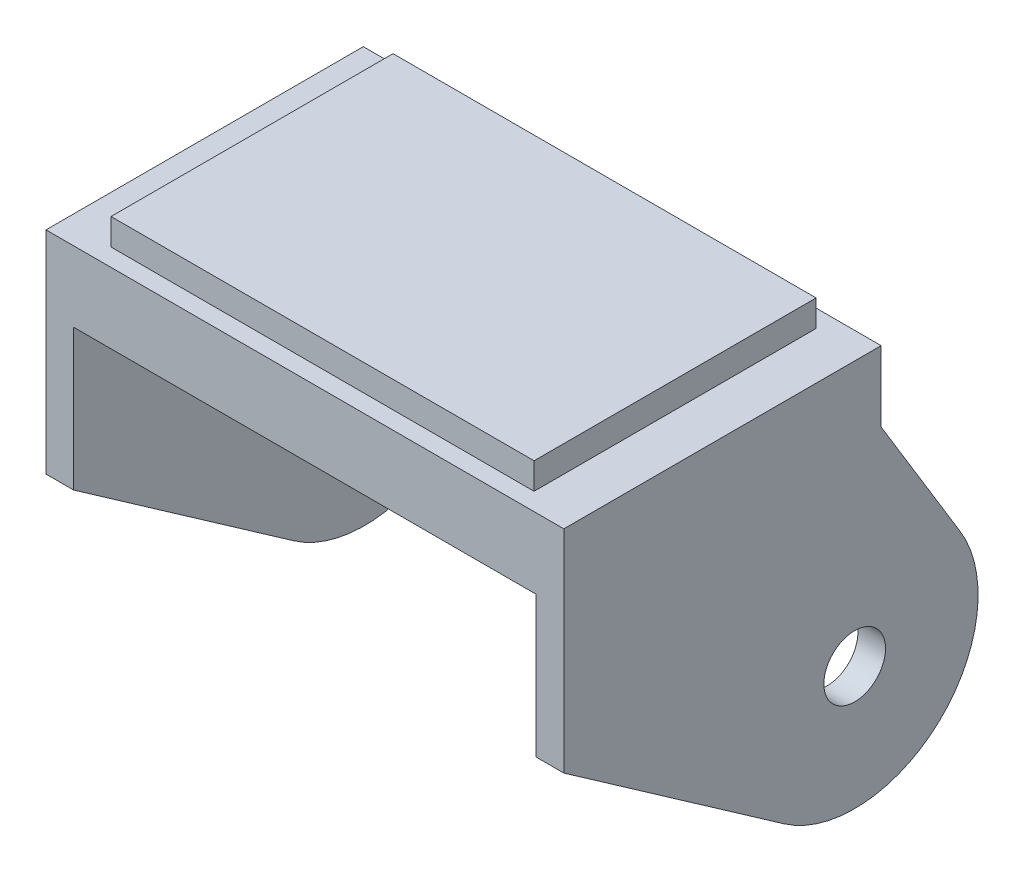
ISO-10303-21;
HEADER;
FILE_DESCRIPTION(('STEP AP214'),'2;1');
FILE_NAME('part.step','',(''),(''),'','','');
FILE_SCHEMA(('AUTOMOTIVE_DESIGN { 1 0 10303 214 1 1 1 1 }'));
ENDSEC;
DATA;
#1=APPLICATION_CONTEXT('core data for automotive mechanical design processes');
#2=APPLICATION_PROTOCOL_DEFINITION('international standard','automotive_design',2000,#1);
#3=PRODUCT_CONTEXT('',#1,'mechanical');
#4=PRODUCT('Part','Part','',(#3));
#5=PRODUCT_RELATED_PRODUCT_CATEGORY('part','',(#4));
#6=PRODUCT_DEFINITION_FORMATION('','',#4);
#7=PRODUCT_DEFINITION_CONTEXT('part definition',#1,'design');
#8=PRODUCT_DEFINITION('design','',#6,#7);
#9=PRODUCT_DEFINITION_SHAPE('','',#8);
#10=(LENGTH_UNIT() NAMED_UNIT(*) SI_UNIT(.MILLI.,.METRE.));
#11=(NAMED_UNIT(*) PLANE_ANGLE_UNIT() SI_UNIT($,.RADIAN.));
#12=(NAMED_UNIT(*) SI_UNIT($,.STERADIAN.) SOLID_ANGLE_UNIT());
#13=UNCERTAINTY_MEASURE_WITH_UNIT(LENGTH_MEASURE(1.E-05),#10,'distance_accuracy_value','');
#14=(GEOMETRIC_REPRESENTATION_CONTEXT(3) GLOBAL_UNCERTAINTY_ASSIGNED_CONTEXT((#13)) GLOBAL_UNIT_ASSIGNED_CONTEXT((#10,
#11,#12)) REPRESENTATION_CONTEXT('',''));
#15=CARTESIAN_POINT('',(0.,0.,0.));
#16=DIRECTION('',(0.,0.,1.));
#17=DIRECTION('',(1.,0.,0.));
#18=AXIS2_PLACEMENT_3D('',#15,#16,#17);
#19=CARTESIAN_POINT('',(23.3172,-8.73125,-14.2875));
#20=DIRECTION('',(0.,1.,0.));
#21=DIRECTION('',(0.,0.,1.));
#22=AXIS2_PLACEMENT_3D('',#19,#20,#21);
#23=PLANE('',#22);
#24=DIRECTION('',(0.,0.,1.));
#25=VECTOR('',#24,1.);
#26=CARTESIAN_POINT('',(20.828,-8.73125,-14.2875));
#27=LINE('',#26,#25);
#28=CARTESIAN_POINT('',(20.828,-8.73125,-14.2875));
#29=VERTEX_POINT('',#28);
#30=CARTESIAN_POINT('',(20.828,-8.73125,14.2875));
#31=VERTEX_POINT('',#30);
#32=EDGE_CURVE('E378',#29,#31,#27,.T.);
#33=ORIENTED_EDGE('',*,*,#32,.T.);
#34=DIRECTION('',(-1.,0.,0.));
#35=VECTOR('',#34,1.);
#36=CARTESIAN_POINT('',(23.3172,-8.73125,14.2875));
#37=LINE('',#36,#35);
#38=CARTESIAN_POINT('',(-20.828,-8.73125,14.2875));
#39=VERTEX_POINT('',#38);
#40=EDGE_CURVE('E364',#31,#39,#37,.T.);
#41=ORIENTED_EDGE('',*,*,#40,.T.);
#42=DIRECTION('',(0.,0.,1.));
#43=VECTOR('',#42,1.);
#44=CARTESIAN_POINT('',(-20.828,-8.73125,14.2875));
#45=LINE('',#44,#43);
#46=CARTESIAN_POINT('',(-20.828,-8.73125,-14.2875));
#47=VERTEX_POINT('',#46);
#48=EDGE_CURVE('E547',#47,#39,#45,.T.);
#49=ORIENTED_EDGE('',*,*,#48,.F.);
#50=DIRECTION('',(1.,0.,0.));
#51=VECTOR('',#50,1.);
#52=CARTESIAN_POINT('',(23.3172,-8.73125,-14.2875));
#53=LINE('',#52,#51);
#54=EDGE_CURVE('E575',#47,#29,#53,.T.);
#55=ORIENTED_EDGE('',*,*,#54,.T.);
#56=EDGE_LOOP('',(#33,#41,#49,#55));
#57=FACE_BOUND('',#56,.T.);
#58=ADVANCED_FACE('F360',(#57),#23,.F.);
#59=CARTESIAN_POINT('',(-19.05,-2.38125,-12.7));
#60=DIRECTION('',(-1.,0.,0.));
#61=DIRECTION('',(0.,0.,1.));
#62=AXIS2_PLACEMENT_3D('',#59,#60,#61);
#63=PLANE('',#62);
#64=DIRECTION('',(0.,0.,1.));
#65=VECTOR('',#64,1.);
#66=CARTESIAN_POINT('',(-19.05,0.,-12.7));
#67=LINE('',#66,#65);
#68=CARTESIAN_POINT('',(-19.05,0.,-12.7));
#69=VERTEX_POINT('',#68);
#70=CARTESIAN_POINT('',(-19.05,0.,12.7));
#71=VERTEX_POINT('',#70);
#72=EDGE_CURVE('E482',#69,#71,#67,.T.);
#73=ORIENTED_EDGE('',*,*,#72,.F.);
#74=DIRECTION('',(0.,1.,0.));
#75=VECTOR('',#74,1.);
#76=CARTESIAN_POINT('',(-19.05,-2.38125,-12.7));
#77=LINE('',#76,#75);
#78=CARTESIAN_POINT('',(-19.05,-2.38125,-12.7));
#79=VERTEX_POINT('',#78);
#80=EDGE_CURVE('E11',#79,#69,#77,.T.);
#81=ORIENTED_EDGE('',*,*,#80,.F.);
#82=DIRECTION('',(0.,0.,1.));
#83=VECTOR('',#82,1.);
#84=CARTESIAN_POINT('',(-19.05,-2.38125,-12.7));
#85=LINE('',#84,#83);
#86=CARTESIAN_POINT('',(-19.05,-2.38125,12.7));
#87=VERTEX_POINT('',#86);
#88=EDGE_CURVE('E601',#79,#87,#85,.T.);
#89=ORIENTED_EDGE('',*,*,#88,.T.);
#90=DIRECTION('',(0.,1.,0.));
#91=VECTOR('',#90,1.);
#92=CARTESIAN_POINT('',(-19.05,-2.38125,12.7));
#93=LINE('',#92,#91);
#94=EDGE_CURVE('E580',#87,#71,#93,.T.);
#95=ORIENTED_EDGE('',*,*,#94,.T.);
#96=EDGE_LOOP('',(#73,#81,#89,#95));
#97=FACE_BOUND('',#96,.T.);
#98=ADVANCED_FACE('F362',(#97),#63,.T.);
#99=CARTESIAN_POINT('',(-19.05,-2.38125,-12.7));
#100=DIRECTION('',(0.,0.,-1.));
#101=DIRECTION('',(-1.,0.,0.));
#102=AXIS2_PLACEMENT_3D('',#99,#100,#101);
#103=PLANE('',#102);
#104=DIRECTION('',(-1.,0.,0.));
#105=VECTOR('',#104,1.);
#106=CARTESIAN_POINT('',(-19.05,0.,-12.7));
#107=LINE('',#106,#105);
#108=CARTESIAN_POINT('',(19.05,0.,-12.7));
#109=VERTEX_POINT('',#108);
#110=EDGE_CURVE('E598',#109,#69,#107,.T.);
#111=ORIENTED_EDGE('',*,*,#110,.F.);
#112=DIRECTION('',(0.,1.,0.));
#113=VECTOR('',#112,1.);
#114=CARTESIAN_POINT('',(19.05,-2.38125,-12.7));
#115=LINE('',#114,#113);
#116=CARTESIAN_POINT('',(19.05,-2.38125,-12.7));
#117=VERTEX_POINT('',#116);
#118=EDGE_CURVE('E370',#117,#109,#115,.T.);
#119=ORIENTED_EDGE('',*,*,#118,.F.);
#120=DIRECTION('',(-1.,0.,0.));
#121=VECTOR('',#120,1.);
#122=CARTESIAN_POINT('',(-19.05,-2.38125,-12.7));
#123=LINE('',#122,#121);
#124=EDGE_CURVE('E610',#117,#79,#123,.T.);
#125=ORIENTED_EDGE('',*,*,#124,.T.);
#126=ORIENTED_EDGE('',*,*,#80,.T.);
#127=EDGE_LOOP('',(#111,#119,#125,#126));
#128=FACE_BOUND('',#127,.T.);
#129=ADVANCED_FACE('F628',(#128),#103,.T.);
#130=CARTESIAN_POINT('',(19.05,-2.38125,-12.7));
#131=DIRECTION('',(1.,0.,0.));
#132=DIRECTION('',(0.,0.,-1.));
#133=AXIS2_PLACEMENT_3D('',#130,#131,#132);
#134=PLANE('',#133);
#135=DIRECTION('',(0.,0.,-1.));
#136=VECTOR('',#135,1.);
#137=CARTESIAN_POINT('',(19.05,0.,-12.7));
#138=LINE('',#137,#136);
#139=CARTESIAN_POINT('',(19.05,0.,12.7));
#140=VERTEX_POINT('',#139);
#141=EDGE_CURVE('E595',#140,#109,#138,.T.);
#142=ORIENTED_EDGE('',*,*,#141,.F.);
#143=DIRECTION('',(0.,1.,0.));
#144=VECTOR('',#143,1.);
#145=CARTESIAN_POINT('',(19.05,-2.38125,12.7));
#146=LINE('',#145,#144);
#147=CARTESIAN_POINT('',(19.05,-2.38125,12.7));
#148=VERTEX_POINT('',#147);
#149=EDGE_CURVE('E613',#148,#140,#146,.T.);
#150=ORIENTED_EDGE('',*,*,#149,.F.);
#151=DIRECTION('',(0.,0.,-1.));
#152=VECTOR('',#151,1.);
#153=CARTESIAN_POINT('',(19.05,-2.38125,-12.7));
#154=LINE('',#153,#152);
#155=EDGE_CURVE('E607',#148,#117,#154,.T.);
#156=ORIENTED_EDGE('',*,*,#155,.T.);
#157=ORIENTED_EDGE('',*,*,#118,.T.);
#158=EDGE_LOOP('',(#142,#150,#156,#157));
#159=FACE_BOUND('',#158,.T.);
#160=ADVANCED_FACE('F633',(#159),#134,.T.);
#161=CARTESIAN_POINT('',(-19.05,-2.38125,12.7));
#162=DIRECTION('',(0.,0.,1.));
#163=DIRECTION('',(1.,0.,0.));
#164=AXIS2_PLACEMENT_3D('',#161,#162,#163);
#165=PLANE('',#164);
#166=DIRECTION('',(1.,0.,0.));
#167=VECTOR('',#166,1.);
#168=CARTESIAN_POINT('',(-19.05,0.,12.7));
#169=LINE('',#168,#167);
#170=EDGE_CURVE('E592',#71,#140,#169,.T.);
#171=ORIENTED_EDGE('',*,*,#170,.F.);
#172=ORIENTED_EDGE('',*,*,#94,.F.);
#173=DIRECTION('',(1.,0.,0.));
#174=VECTOR('',#173,1.);
#175=CARTESIAN_POINT('',(-19.05,-2.38125,12.7));
#176=LINE('',#175,#174);
#177=EDGE_CURVE('E604',#87,#148,#176,.T.);
#178=ORIENTED_EDGE('',*,*,#177,.T.);
#179=ORIENTED_EDGE('',*,*,#149,.T.);
#180=EDGE_LOOP('',(#171,#172,#178,#179));
#181=FACE_BOUND('',#180,.T.);
#182=ADVANCED_FACE('F622',(#181),#165,.T.);
#183=CARTESIAN_POINT('',(-19.05,0.,12.7));
#184=DIRECTION('',(0.,1.,0.));
#185=DIRECTION('',(0.,0.,1.));
#186=AXIS2_PLACEMENT_3D('',#183,#184,#185);
#187=PLANE('',#186);
#188=ORIENTED_EDGE('',*,*,#72,.T.);
#189=ORIENTED_EDGE('',*,*,#170,.T.);
#190=ORIENTED_EDGE('',*,*,#141,.T.);
#191=ORIENTED_EDGE('',*,*,#110,.T.);
#192=EDGE_LOOP('',(#188,#189,#190,#191));
#193=FACE_BOUND('',#192,.T.);
#194=ADVANCED_FACE('F624',(#193),#187,.T.);
#195=CARTESIAN_POINT('',(23.3172,-8.73125,14.2875));
#196=DIRECTION('',(-1.,0.,0.));
#197=DIRECTION('',(0.,0.,1.));
#198=AXIS2_PLACEMENT_3D('',#195,#196,#197);
#199=PLANE('',#198);
#200=DIRECTION('',(0.,0.,1.));
#201=VECTOR('',#200,1.);
#202=CARTESIAN_POINT('',(23.3172,-2.38125,14.2875));
#203=LINE('',#202,#201);
#204=CARTESIAN_POINT('',(23.3172,-2.38125,-14.2875));
#205=VERTEX_POINT('',#204);
#206=CARTESIAN_POINT('',(23.3172,-2.38125,14.2875));
#207=VERTEX_POINT('',#206);
#208=EDGE_CURVE('E480',#205,#207,#203,.T.);
#209=ORIENTED_EDGE('',*,*,#208,.T.);
#210=DIRECTION('',(0.,1.,0.));
#211=VECTOR('',#210,1.);
#212=CARTESIAN_POINT('',(23.3172,-8.73125,14.2875));
#213=LINE('',#212,#211);
#214=CARTESIAN_POINT('',(23.3172,-21.43125,14.2875));
#215=VERTEX_POINT('',#214);
#216=EDGE_CURVE('E471',#215,#207,#213,.T.);
#217=ORIENTED_EDGE('',*,*,#216,.F.);
#218=DIRECTION('',(0.,-0.573224006977367,-0.819398705042186));
#219=VECTOR('',#218,1.);
#220=CARTESIAN_POINT('',(23.3172,-21.43125,14.2875));
#221=LINE('',#220,#219);
#222=CARTESIAN_POINT('',(23.3172,-35.2993181097813,-5.536298222464));
#223=VERTEX_POINT('',#222);
#224=EDGE_CURVE('E477',#215,#223,#221,.T.);
#225=ORIENTED_EDGE('',*,*,#224,.T.);
#226=CARTESIAN_POINT('',(23.3172,-26.19375,-11.90625));
#227=DIRECTION('',(1.,0.,0.));
#228=DIRECTION('',(0.,0.,-1.));
#229=AXIS2_PLACEMENT_3D('',#226,#227,#228);
#230=CIRCLE('',#229,11.1125);
#231=CARTESIAN_POINT('',(23.3172,-20.416626413158,-21.3990103631585));
#232=VERTEX_POINT('',#231);
#233=EDGE_CURVE('E498',#223,#232,#230,.T.);
#234=ORIENTED_EDGE('',*,*,#233,.T.);
#235=DIRECTION('',(0.,0.854241652477707,0.519876138298495));
#236=VECTOR('',#235,1.);
#237=CARTESIAN_POINT('',(23.3172,-20.416626413158,-21.3990103631585));
#238=LINE('',#237,#236);
#239=CARTESIAN_POINT('',(23.3172,-8.73125,-14.2875));
#240=VERTEX_POINT('',#239);
#241=EDGE_CURVE('E501',#232,#240,#238,.T.);
#242=ORIENTED_EDGE('',*,*,#241,.T.);
#243=DIRECTION('',(0.,1.,0.));
#244=VECTOR('',#243,1.);
#245=CARTESIAN_POINT('',(23.3172,-8.73125,-14.2875));
#246=LINE('',#245,#244);
#247=EDGE_CURVE('E574',#240,#205,#246,.T.);
#248=ORIENTED_EDGE('',*,*,#247,.T.);
#249=EDGE_LOOP('',(#209,#217,#225,#234,#242,#248));
#250=FACE_BOUND('',#249,.T.);
#251=CARTESIAN_POINT('',(23.3172,-26.19375,-11.90625));
#252=DIRECTION('',(1.,0.,0.));
#253=DIRECTION('',(0.,0.,-1.));
#254=AXIS2_PLACEMENT_3D('',#251,#252,#253);
#255=CIRCLE('',#254,2.778125);
#256=CARTESIAN_POINT('',(23.3172,-26.19375,-14.684375));
#257=VERTEX_POINT('',#256);
#258=EDGE_CURVE('E504',#257,#257,#255,.T.);
#259=ORIENTED_EDGE('',*,*,#258,.F.);
#260=EDGE_LOOP('',(#259));
#261=FACE_BOUND('',#260,.T.);
#262=ADVANCED_FACE('F473',(#250,#261),#199,.F.);
#263=CARTESIAN_POINT('',(23.3172,-8.73125,14.2875));
#264=DIRECTION('',(0.,0.,-1.));
#265=DIRECTION('',(-1.,0.,0.));
#266=AXIS2_PLACEMENT_3D('',#263,#264,#265);
#267=PLANE('',#266);
#268=DIRECTION('',(-1.,0.,0.));
#269=VECTOR('',#268,1.);
#270=CARTESIAN_POINT('',(23.3172,-2.38125,14.2875));
#271=LINE('',#270,#269);
#272=CARTESIAN_POINT('',(-23.3172,-2.38125,14.2875));
#273=VERTEX_POINT('',#272);
#274=EDGE_CURVE('E790',#207,#273,#271,.T.);
#275=ORIENTED_EDGE('',*,*,#274,.T.);
#276=DIRECTION('',(0.,1.,0.));
#277=VECTOR('',#276,1.);
#278=CARTESIAN_POINT('',(-23.3172,-8.73125,14.2875));
#279=LINE('',#278,#277);
#280=CARTESIAN_POINT('',(-23.3172,-21.43125,14.2875));
#281=VERTEX_POINT('',#280);
#282=EDGE_CURVE('E483',#281,#273,#279,.T.);
#283=ORIENTED_EDGE('',*,*,#282,.F.);
#284=DIRECTION('',(-1.,0.,0.));
#285=VECTOR('',#284,1.);
#286=CARTESIAN_POINT('',(-20.828,-21.43125,14.2875));
#287=LINE('',#286,#285);
#288=CARTESIAN_POINT('',(-20.828,-21.43125,14.2875));
#289=VERTEX_POINT('',#288);
#290=EDGE_CURVE('E791',#289,#281,#287,.T.);
#291=ORIENTED_EDGE('',*,*,#290,.F.);
#292=DIRECTION('',(0.,-1.,0.));
#293=VECTOR('',#292,1.);
#294=CARTESIAN_POINT('',(-20.828,-8.73125,14.2875));
#295=LINE('',#294,#293);
#296=EDGE_CURVE('E536',#39,#289,#295,.T.);
#297=ORIENTED_EDGE('',*,*,#296,.F.);
#298=ORIENTED_EDGE('',*,*,#40,.F.);
#299=DIRECTION('',(0.,-1.,0.));
#300=VECTOR('',#299,1.);
#301=CARTESIAN_POINT('',(20.828,-8.73125,14.2875));
#302=LINE('',#301,#300);
#303=CARTESIAN_POINT('',(20.828,-21.43125,14.2875));
#304=VERTEX_POINT('',#303);
#305=EDGE_CURVE('E489',#31,#304,#302,.T.);
#306=ORIENTED_EDGE('',*,*,#305,.T.);
#307=DIRECTION('',(1.,0.,0.));
#308=VECTOR('',#307,1.);
#309=CARTESIAN_POINT('',(20.828,-21.43125,14.2875));
#310=LINE('',#309,#308);
#311=EDGE_CURVE('E486',#304,#215,#310,.T.);
#312=ORIENTED_EDGE('',*,*,#311,.T.);
#313=ORIENTED_EDGE('',*,*,#216,.T.);
#314=EDGE_LOOP('',(#275,#283,#291,#297,#298,#306,#312,#313));
#315=FACE_BOUND('',#314,.T.);
#316=ADVANCED_FACE('F487',(#315),#267,.F.);
#317=CARTESIAN_POINT('',(-23.3172,-8.73125,14.2875));
#318=DIRECTION('',(1.,0.,0.));
#319=DIRECTION('',(0.,0.,-1.));
#320=AXIS2_PLACEMENT_3D('',#317,#318,#319);
#321=PLANE('',#320);
#322=DIRECTION('',(0.,0.,-1.));
#323=VECTOR('',#322,1.);
#324=CARTESIAN_POINT('',(-23.3172,-2.38125,14.2875));
#325=LINE('',#324,#323);
#326=CARTESIAN_POINT('',(-23.3172,-2.38125,-14.2875));
#327=VERTEX_POINT('',#326);
#328=EDGE_CURVE('E793',#273,#327,#325,.T.);
#329=ORIENTED_EDGE('',*,*,#328,.T.);
#330=DIRECTION('',(0.,1.,0.));
#331=VECTOR('',#330,1.);
#332=CARTESIAN_POINT('',(-23.3172,-8.73125,-14.2875));
#333=LINE('',#332,#331);
#334=CARTESIAN_POINT('',(-23.3172,-8.73125,-14.2875));
#335=VERTEX_POINT('',#334);
#336=EDGE_CURVE('E576',#335,#327,#333,.T.);
#337=ORIENTED_EDGE('',*,*,#336,.F.);
#338=DIRECTION('',(0.,0.854241652477708,0.519876138298495));
#339=VECTOR('',#338,1.);
#340=CARTESIAN_POINT('',(-23.3172,-8.73125,-14.2875));
#341=LINE('',#340,#339);
#342=CARTESIAN_POINT('',(-23.3172,-20.416626413158,-21.3990103631585));
#343=VERTEX_POINT('',#342);
#344=EDGE_CURVE('E533',#343,#335,#341,.T.);
#345=ORIENTED_EDGE('',*,*,#344,.F.);
#346=CARTESIAN_POINT('',(-23.3172,-26.19375,-11.90625));
#347=DIRECTION('',(1.,0.,0.));
#348=DIRECTION('',(0.,0.,-1.));
#349=AXIS2_PLACEMENT_3D('',#346,#347,#348);
#350=CIRCLE('',#349,11.1125);
#351=CARTESIAN_POINT('',(-23.3172,-35.2993181097813,-5.53629822246401));
#352=VERTEX_POINT('',#351);
#353=EDGE_CURVE('E531',#352,#343,#350,.T.);
#354=ORIENTED_EDGE('',*,*,#353,.F.);
#355=DIRECTION('',(0.,-0.573224006977367,-0.819398705042186));
#356=VECTOR('',#355,1.);
#357=CARTESIAN_POINT('',(-23.3172,-21.43125,14.2875));
#358=LINE('',#357,#356);
#359=EDGE_CURVE('E529',#281,#352,#358,.T.);
#360=ORIENTED_EDGE('',*,*,#359,.F.);
#361=ORIENTED_EDGE('',*,*,#282,.T.);
#362=EDGE_LOOP('',(#329,#337,#345,#354,#360,#361));
#363=FACE_BOUND('',#362,.T.);
#364=CARTESIAN_POINT('',(-23.3172,-26.19375,-11.90625));
#365=DIRECTION('',(1.,0.,0.));
#366=DIRECTION('',(0.,0.,-1.));
#367=AXIS2_PLACEMENT_3D('',#364,#365,#366);
#368=CIRCLE('',#367,2.778125);
#369=CARTESIAN_POINT('',(-23.3172,-26.19375,-14.684375));
#370=VERTEX_POINT('',#369);
#371=EDGE_CURVE('E520',#370,#370,#368,.T.);
#372=ORIENTED_EDGE('',*,*,#371,.T.);
#373=EDGE_LOOP('',(#372));
#374=FACE_BOUND('',#373,.T.);
#375=ADVANCED_FACE('F654',(#363,#374),#321,.F.);
#376=CARTESIAN_POINT('',(23.3172,-8.73125,-14.2875));
#377=DIRECTION('',(0.,0.,1.));
#378=DIRECTION('',(1.,0.,0.));
#379=AXIS2_PLACEMENT_3D('',#376,#377,#378);
#380=PLANE('',#379);
#381=DIRECTION('',(1.,0.,0.));
#382=VECTOR('',#381,1.);
#383=CARTESIAN_POINT('',(23.3172,-2.38125,-14.2875));
#384=LINE('',#383,#382);
#385=EDGE_CURVE('E578',#327,#205,#384,.T.);
#386=ORIENTED_EDGE('',*,*,#385,.T.);
#387=ORIENTED_EDGE('',*,*,#247,.F.);
#388=DIRECTION('',(1.,0.,0.));
#389=VECTOR('',#388,1.);
#390=CARTESIAN_POINT('',(20.828,-8.73125,-14.2875));
#391=LINE('',#390,#389);
#392=EDGE_CURVE('E386',#29,#240,#391,.T.);
#393=ORIENTED_EDGE('',*,*,#392,.F.);
#394=ORIENTED_EDGE('',*,*,#54,.F.);
#395=EDGE_CURVE('E551',#335,#47,#53,.T.);
#396=ORIENTED_EDGE('',*,*,#395,.F.);
#397=ORIENTED_EDGE('',*,*,#336,.T.);
#398=EDGE_LOOP('',(#386,#387,#393,#394,#396,#397));
#399=FACE_BOUND('',#398,.T.);
#400=ADVANCED_FACE('F651',(#399),#380,.F.);
#401=CARTESIAN_POINT('',(23.3172,-2.38125,-14.2875));
#402=DIRECTION('',(0.,1.,0.));
#403=DIRECTION('',(0.,0.,1.));
#404=AXIS2_PLACEMENT_3D('',#401,#402,#403);
#405=PLANE('',#404);
#406=ORIENTED_EDGE('',*,*,#177,.F.);
#407=ORIENTED_EDGE('',*,*,#88,.F.);
#408=ORIENTED_EDGE('',*,*,#124,.F.);
#409=ORIENTED_EDGE('',*,*,#155,.F.);
#410=EDGE_LOOP('',(#406,#407,#408,#409));
#411=FACE_BOUND('',#410,.T.);
#412=ORIENTED_EDGE('',*,*,#208,.F.);
#413=ORIENTED_EDGE('',*,*,#385,.F.);
#414=ORIENTED_EDGE('',*,*,#328,.F.);
#415=ORIENTED_EDGE('',*,*,#274,.F.);
#416=EDGE_LOOP('',(#412,#413,#414,#415));
#417=FACE_BOUND('',#416,.T.);
#418=ADVANCED_FACE('F630',(#411,#417),#405,.T.);
#419=CARTESIAN_POINT('',(-20.828,-26.19375,-11.90625));
#420=DIRECTION('',(1.,0.,0.));
#421=DIRECTION('',(0.,0.,-1.));
#422=AXIS2_PLACEMENT_3D('',#419,#420,#421);
#423=PLANE('',#422);
#424=ORIENTED_EDGE('',*,*,#296,.T.);
#425=DIRECTION('',(0.,-0.573224006977367,-0.819398705042186));
#426=VECTOR('',#425,1.);
#427=CARTESIAN_POINT('',(-20.828,-21.43125,14.2875));
#428=LINE('',#427,#426);
#429=CARTESIAN_POINT('',(-20.828,-35.2993181097813,-5.53629822246401));
#430=VERTEX_POINT('',#429);
#431=EDGE_CURVE('E537',#289,#430,#428,.T.);
#432=ORIENTED_EDGE('',*,*,#431,.T.);
#433=CARTESIAN_POINT('',(-20.828,-26.19375,-11.90625));
#434=DIRECTION('',(1.,0.,0.));
#435=DIRECTION('',(0.,0.,-1.));
#436=AXIS2_PLACEMENT_3D('',#433,#434,#435);
#437=CIRCLE('',#436,11.1125);
#438=CARTESIAN_POINT('',(-20.828,-20.416626413158,-21.3990103631585));
#439=VERTEX_POINT('',#438);
#440=EDGE_CURVE('E539',#430,#439,#437,.T.);
#441=ORIENTED_EDGE('',*,*,#440,.T.);
#442=DIRECTION('',(0.,0.854241652477708,0.519876138298495));
#443=VECTOR('',#442,1.);
#444=CARTESIAN_POINT('',(-20.828,-8.73125,-14.2875));
#445=LINE('',#444,#443);
#446=EDGE_CURVE('E541',#439,#47,#445,.T.);
#447=ORIENTED_EDGE('',*,*,#446,.T.);
#448=ORIENTED_EDGE('',*,*,#48,.T.);
#449=EDGE_LOOP('',(#424,#432,#441,#447,#448));
#450=FACE_BOUND('',#449,.T.);
#451=CARTESIAN_POINT('',(-20.828,-26.19375,-11.90625));
#452=DIRECTION('',(1.,0.,0.));
#453=DIRECTION('',(0.,0.,-1.));
#454=AXIS2_PLACEMENT_3D('',#451,#452,#453);
#455=CIRCLE('',#454,2.778125);
#456=CARTESIAN_POINT('',(-20.828,-26.19375,-14.684375));
#457=VERTEX_POINT('',#456);
#458=EDGE_CURVE('E526',#457,#457,#455,.T.);
#459=ORIENTED_EDGE('',*,*,#458,.F.);
#460=EDGE_LOOP('',(#459));
#461=FACE_BOUND('',#460,.T.);
#462=ADVANCED_FACE('F563',(#450,#461),#423,.T.);
#463=CARTESIAN_POINT('',(-20.828,-21.43125,14.2875));
#464=DIRECTION('',(0.,0.819398705042186,-0.573224006977367));
#465=DIRECTION('',(0.,0.573224006977367,0.819398705042186));
#466=AXIS2_PLACEMENT_3D('',#463,#464,#465);
#467=PLANE('',#466);
#468=ORIENTED_EDGE('',*,*,#359,.T.);
#469=DIRECTION('',(-1.,0.,0.));
#470=VECTOR('',#469,1.);
#471=CARTESIAN_POINT('',(-20.828,-35.2993181097813,-5.53629822246401));
#472=LINE('',#471,#470);
#473=EDGE_CURVE('E796',#430,#352,#472,.T.);
#474=ORIENTED_EDGE('',*,*,#473,.F.);
#475=ORIENTED_EDGE('',*,*,#431,.F.);
#476=ORIENTED_EDGE('',*,*,#290,.T.);
#477=EDGE_LOOP('',(#468,#474,#475,#476));
#478=FACE_BOUND('',#477,.T.);
#479=ADVANCED_FACE('F697',(#478),#467,.F.);
#480=CARTESIAN_POINT('',(-20.828,-26.19375,-11.90625));
#481=DIRECTION('',(-1.,0.,0.));
#482=DIRECTION('',(0.,0.,1.));
#483=AXIS2_PLACEMENT_3D('',#480,#481,#482);
#484=CYLINDRICAL_SURFACE('',#483,11.1125);
#485=ORIENTED_EDGE('',*,*,#353,.T.);
#486=DIRECTION('',(-1.,0.,0.));
#487=VECTOR('',#486,1.);
#488=CARTESIAN_POINT('',(-20.828,-20.416626413158,-21.3990103631585));
#489=LINE('',#488,#487);
#490=EDGE_CURVE('E544',#439,#343,#489,.T.);
#491=ORIENTED_EDGE('',*,*,#490,.F.);
#492=ORIENTED_EDGE('',*,*,#440,.F.);
#493=ORIENTED_EDGE('',*,*,#473,.T.);
#494=EDGE_LOOP('',(#485,#491,#492,#493));
#495=FACE_BOUND('',#494,.T.);
#496=ADVANCED_FACE('F704',(#495),#484,.T.);
#497=CARTESIAN_POINT('',(-20.828,-8.73125,-14.2875));
#498=DIRECTION('',(0.,-0.519876138298495,0.854241652477708));
#499=DIRECTION('',(0.,-0.854241652477708,-0.519876138298495));
#500=AXIS2_PLACEMENT_3D('',#497,#498,#499);
#501=PLANE('',#500);
#502=ORIENTED_EDGE('',*,*,#344,.T.);
#503=ORIENTED_EDGE('',*,*,#395,.T.);
#504=ORIENTED_EDGE('',*,*,#446,.F.);
#505=ORIENTED_EDGE('',*,*,#490,.T.);
#506=EDGE_LOOP('',(#502,#503,#504,#505));
#507=FACE_BOUND('',#506,.T.);
#508=ADVANCED_FACE('F571',(#507),#501,.F.);
#509=CARTESIAN_POINT('',(-20.828,-26.19375,-11.90625));
#510=DIRECTION('',(-1.,0.,0.));
#511=DIRECTION('',(0.,0.,1.));
#512=AXIS2_PLACEMENT_3D('',#509,#510,#511);
#513=CYLINDRICAL_SURFACE('',#512,2.778125);
#514=ORIENTED_EDGE('',*,*,#458,.T.);
#515=EDGE_LOOP('',(#514));
#516=FACE_BOUND('',#515,.T.);
#517=ORIENTED_EDGE('',*,*,#371,.F.);
#518=EDGE_LOOP('',(#517));
#519=FACE_BOUND('',#518,.T.);
#520=ADVANCED_FACE('F717',(#516,#519),#513,.F.);
#521=CARTESIAN_POINT('',(20.828,-20.416626413158,-21.3990103631585));
#522=DIRECTION('',(0.,0.519876138298495,-0.854241652477708));
#523=DIRECTION('',(0.,0.854241652477708,0.519876138298495));
#524=AXIS2_PLACEMENT_3D('',#521,#522,#523);
#525=PLANE('',#524);
#526=ORIENTED_EDGE('',*,*,#241,.F.);
#527=DIRECTION('',(1.,0.,0.));
#528=VECTOR('',#527,1.);
#529=CARTESIAN_POINT('',(20.828,-20.416626413158,-21.3990103631585));
#530=LINE('',#529,#528);
#531=CARTESIAN_POINT('',(20.828,-20.416626413158,-21.3990103631585));
#532=VERTEX_POINT('',#531);
#533=EDGE_CURVE('E521',#532,#232,#530,.T.);
#534=ORIENTED_EDGE('',*,*,#533,.F.);
#535=DIRECTION('',(0.,0.854241652477707,0.519876138298495));
#536=VECTOR('',#535,1.);
#537=CARTESIAN_POINT('',(20.828,-20.416626413158,-21.3990103631585));
#538=LINE('',#537,#536);
#539=EDGE_CURVE('E494',#532,#29,#538,.T.);
#540=ORIENTED_EDGE('',*,*,#539,.T.);
#541=ORIENTED_EDGE('',*,*,#392,.T.);
#542=EDGE_LOOP('',(#526,#534,#540,#541));
#543=FACE_BOUND('',#542,.T.);
#544=ADVANCED_FACE('F723',(#543),#525,.T.);
#545=CARTESIAN_POINT('',(20.828,-26.19375,-11.90625));
#546=DIRECTION('',(1.,0.,0.));
#547=DIRECTION('',(0.,0.,-1.));
#548=AXIS2_PLACEMENT_3D('',#545,#546,#547);
#549=CYLINDRICAL_SURFACE('',#548,11.1125);
#550=ORIENTED_EDGE('',*,*,#233,.F.);
#551=DIRECTION('',(1.,0.,0.));
#552=VECTOR('',#551,1.);
#553=CARTESIAN_POINT('',(20.828,-35.2993181097813,-5.536298222464));
#554=LINE('',#553,#552);
#555=CARTESIAN_POINT('',(20.828,-35.2993181097813,-5.536298222464));
#556=VERTEX_POINT('',#555);
#557=EDGE_CURVE('E493',#556,#223,#554,.T.);
#558=ORIENTED_EDGE('',*,*,#557,.F.);
#559=CARTESIAN_POINT('',(20.828,-26.19375,-11.90625));
#560=DIRECTION('',(1.,0.,0.));
#561=DIRECTION('',(0.,0.,-1.));
#562=AXIS2_PLACEMENT_3D('',#559,#560,#561);
#563=CIRCLE('',#562,11.1125);
#564=EDGE_CURVE('E514',#556,#532,#563,.T.);
#565=ORIENTED_EDGE('',*,*,#564,.T.);
#566=ORIENTED_EDGE('',*,*,#533,.T.);
#567=EDGE_LOOP('',(#550,#558,#565,#566));
#568=FACE_BOUND('',#567,.T.);
#569=ADVANCED_FACE('F748',(#568),#549,.T.);
#570=CARTESIAN_POINT('',(20.828,-21.43125,14.2875));
#571=DIRECTION('',(0.,-0.819398705042186,0.573224006977367));
#572=DIRECTION('',(0.,-0.573224006977367,-0.819398705042186));
#573=AXIS2_PLACEMENT_3D('',#570,#571,#572);
#574=PLANE('',#573);
#575=ORIENTED_EDGE('',*,*,#224,.F.);
#576=ORIENTED_EDGE('',*,*,#311,.F.);
#577=DIRECTION('',(0.,-0.573224006977367,-0.819398705042186));
#578=VECTOR('',#577,1.);
#579=CARTESIAN_POINT('',(20.828,-21.43125,14.2875));
#580=LINE('',#579,#578);
#581=EDGE_CURVE('E512',#304,#556,#580,.T.);
#582=ORIENTED_EDGE('',*,*,#581,.T.);
#583=ORIENTED_EDGE('',*,*,#557,.T.);
#584=EDGE_LOOP('',(#575,#576,#582,#583));
#585=FACE_BOUND('',#584,.T.);
#586=ADVANCED_FACE('F496',(#585),#574,.T.);
#587=CARTESIAN_POINT('',(20.828,-26.19375,-11.90625));
#588=DIRECTION('',(1.,0.,0.));
#589=DIRECTION('',(0.,0.,-1.));
#590=AXIS2_PLACEMENT_3D('',#587,#588,#589);
#591=PLANE('',#590);
#592=CARTESIAN_POINT('',(20.828,-26.19375,-11.90625));
#593=DIRECTION('',(1.,0.,0.));
#594=DIRECTION('',(0.,0.,-1.));
#595=AXIS2_PLACEMENT_3D('',#592,#593,#594);
#596=CIRCLE('',#595,2.778125);
#597=CARTESIAN_POINT('',(20.828,-26.19375,-14.684375));
#598=VERTEX_POINT('',#597);
#599=EDGE_CURVE('E499',#598,#598,#596,.T.);
#600=ORIENTED_EDGE('',*,*,#599,.T.);
#601=EDGE_LOOP('',(#600));
#602=FACE_BOUND('',#601,.T.);
#603=ORIENTED_EDGE('',*,*,#32,.F.);
#604=ORIENTED_EDGE('',*,*,#539,.F.);
#605=ORIENTED_EDGE('',*,*,#564,.F.);
#606=ORIENTED_EDGE('',*,*,#581,.F.);
#607=ORIENTED_EDGE('',*,*,#305,.F.);
#608=EDGE_LOOP('',(#603,#604,#605,#606,#607));
#609=FACE_BOUND('',#608,.T.);
#610=ADVANCED_FACE('F763',(#602,#609),#591,.F.);
#611=CARTESIAN_POINT('',(20.828,-26.19375,-11.90625));
#612=DIRECTION('',(1.,0.,0.));
#613=DIRECTION('',(0.,0.,-1.));
#614=AXIS2_PLACEMENT_3D('',#611,#612,#613);
#615=CYLINDRICAL_SURFACE('',#614,2.778125);
#616=ORIENTED_EDGE('',*,*,#599,.F.);
#617=EDGE_LOOP('',(#616));
#618=FACE_BOUND('',#617,.T.);
#619=ORIENTED_EDGE('',*,*,#258,.T.);
#620=EDGE_LOOP('',(#619));
#621=FACE_BOUND('',#620,.T.);
#622=ADVANCED_FACE('F770',(#618,#621),#615,.F.);
#623=CLOSED_SHELL('',(#58,#98,#129,#160,#182,#194,#262,#316,#375,#400,#418,#462,#479,#496,#508,
#520,#544,#569,#586,#610,#622));
#624=MANIFOLD_SOLID_BREP('B2',#623);
#625=ADVANCED_BREP_SHAPE_REPRESENTATION('',(#18,#624),#14);
#626=SHAPE_DEFINITION_REPRESENTATION(#9,#625);
ENDSEC;
END-ISO-10303-21;
